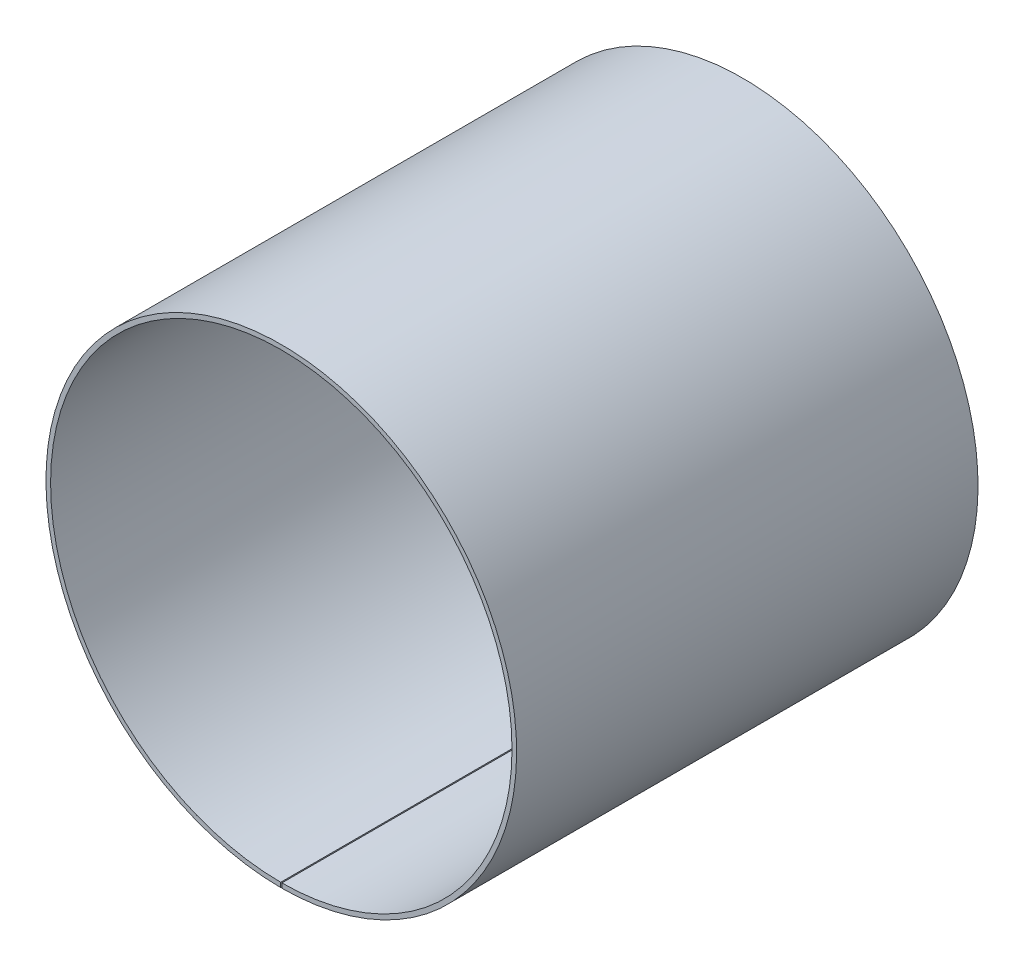
ISO-10303-21;
HEADER;
FILE_DESCRIPTION(('STEP AP214'),'2;1');
FILE_NAME('part.step','',(''),(''),'','','');
FILE_SCHEMA(('AUTOMOTIVE_DESIGN { 1 0 10303 214 1 1 1 1 }'));
ENDSEC;
DATA;
#1=APPLICATION_CONTEXT('core data for automotive mechanical design processes');
#2=APPLICATION_PROTOCOL_DEFINITION('international standard','automotive_design',2000,#1);
#3=PRODUCT_CONTEXT('',#1,'mechanical');
#4=PRODUCT('Part','Part','',(#3));
#5=PRODUCT_RELATED_PRODUCT_CATEGORY('part','',(#4));
#6=PRODUCT_DEFINITION_FORMATION('','',#4);
#7=PRODUCT_DEFINITION_CONTEXT('part definition',#1,'design');
#8=PRODUCT_DEFINITION('design','',#6,#7);
#9=PRODUCT_DEFINITION_SHAPE('','',#8);
#10=(LENGTH_UNIT() NAMED_UNIT(*) SI_UNIT(.MILLI.,.METRE.));
#11=(NAMED_UNIT(*) PLANE_ANGLE_UNIT() SI_UNIT($,.RADIAN.));
#12=(NAMED_UNIT(*) SI_UNIT($,.STERADIAN.) SOLID_ANGLE_UNIT());
#13=UNCERTAINTY_MEASURE_WITH_UNIT(LENGTH_MEASURE(1.E-05),#10,'distance_accuracy_value','');
#14=(GEOMETRIC_REPRESENTATION_CONTEXT(3) GLOBAL_UNCERTAINTY_ASSIGNED_CONTEXT((#13)) GLOBAL_UNIT_ASSIGNED_CONTEXT((#10,
#11,#12)) REPRESENTATION_CONTEXT('',''));
#15=CARTESIAN_POINT('',(0.,0.,0.));
#16=DIRECTION('',(0.,0.,1.));
#17=DIRECTION('',(1.,0.,0.));
#18=AXIS2_PLACEMENT_3D('',#15,#16,#17);
#19=CARTESIAN_POINT('',(0.,0.,200.));
#20=DIRECTION('',(0.,0.,-1.));
#21=DIRECTION('',(-1.,0.,0.));
#22=AXIS2_PLACEMENT_3D('',#19,#20,#21);
#23=CYLINDRICAL_SURFACE('',#22,102.);
#24=CARTESIAN_POINT('',(0.,0.,0.));
#25=DIRECTION('',(0.,0.,1.));
#26=DIRECTION('',(1.,0.,0.));
#27=AXIS2_PLACEMENT_3D('',#24,#25,#26);
#28=CIRCLE('',#27,102.);
#29=CARTESIAN_POINT('',(0.254999999999998,-101.999681249502,0.));
#30=VERTEX_POINT('',#29);
#31=CARTESIAN_POINT('',(-0.255000000000036,-101.999681249502,0.));
#32=VERTEX_POINT('',#31);
#33=EDGE_CURVE('E100',#30,#32,#28,.T.);
#34=ORIENTED_EDGE('',*,*,#33,.T.);
#35=DIRECTION('',(0.,0.,-1.));
#36=VECTOR('',#35,1.);
#37=CARTESIAN_POINT('',(-0.255000000000036,-101.999681249502,200.));
#38=LINE('',#37,#36);
#39=CARTESIAN_POINT('',(-0.255000000000036,-101.999681249502,200.));
#40=VERTEX_POINT('',#39);
#41=EDGE_CURVE('E11',#40,#32,#38,.T.);
#42=ORIENTED_EDGE('',*,*,#41,.F.);
#43=CARTESIAN_POINT('',(0.,0.,200.));
#44=DIRECTION('',(0.,0.,1.));
#45=DIRECTION('',(1.,0.,0.));
#46=AXIS2_PLACEMENT_3D('',#43,#44,#45);
#47=CIRCLE('',#46,102.);
#48=CARTESIAN_POINT('',(0.254999999999998,-101.999681249502,200.));
#49=VERTEX_POINT('',#48);
#50=EDGE_CURVE('E77',#49,#40,#47,.T.);
#51=ORIENTED_EDGE('',*,*,#50,.F.);
#52=DIRECTION('',(0.,0.,-1.));
#53=VECTOR('',#52,1.);
#54=CARTESIAN_POINT('',(0.254999999999998,-101.999681249502,200.));
#55=LINE('',#54,#53);
#56=EDGE_CURVE('E53',#49,#30,#55,.T.);
#57=ORIENTED_EDGE('',*,*,#56,.T.);
#58=EDGE_LOOP('',(#34,#42,#51,#57));
#59=FACE_BOUND('',#58,.T.);
#60=ADVANCED_FACE('F37',(#59),#23,.T.);
#61=CARTESIAN_POINT('',(-0.250000000000035,-99.9996874995117,200.));
#62=DIRECTION('',(0.999996874995117,-0.00250000000000034,0.));
#63=DIRECTION('',(0.00250000000000034,0.999996874995117,0.));
#64=AXIS2_PLACEMENT_3D('',#61,#62,#63);
#65=PLANE('',#64);
#66=DIRECTION('',(-0.00250000000000034,-0.999996874995117,0.));
#67=VECTOR('',#66,1.);
#68=CARTESIAN_POINT('',(-0.250000000000035,-99.9996874995117,0.));
#69=LINE('',#68,#67);
#70=CARTESIAN_POINT('',(-0.250000000000035,-99.9996874995117,0.));
#71=VERTEX_POINT('',#70);
#72=EDGE_CURVE('E86',#71,#32,#69,.T.);
#73=ORIENTED_EDGE('',*,*,#72,.F.);
#74=DIRECTION('',(0.,0.,-1.));
#75=VECTOR('',#74,1.);
#76=CARTESIAN_POINT('',(-0.250000000000035,-99.9996874995117,200.));
#77=LINE('',#76,#75);
#78=CARTESIAN_POINT('',(-0.250000000000035,-99.9996874995117,200.));
#79=VERTEX_POINT('',#78);
#80=EDGE_CURVE('E45',#79,#71,#77,.T.);
#81=ORIENTED_EDGE('',*,*,#80,.F.);
#82=DIRECTION('',(-0.00250000000000034,-0.999996874995117,0.));
#83=VECTOR('',#82,1.);
#84=CARTESIAN_POINT('',(-0.250000000000035,-99.9996874995117,200.));
#85=LINE('',#84,#83);
#86=EDGE_CURVE('E84',#79,#40,#85,.T.);
#87=ORIENTED_EDGE('',*,*,#86,.T.);
#88=ORIENTED_EDGE('',*,*,#41,.T.);
#89=EDGE_LOOP('',(#73,#81,#87,#88));
#90=FACE_BOUND('',#89,.T.);
#91=ADVANCED_FACE('F83',(#90),#65,.T.);
#92=CARTESIAN_POINT('',(0.,0.,200.));
#93=DIRECTION('',(0.,0.,-1.));
#94=DIRECTION('',(-1.,0.,0.));
#95=AXIS2_PLACEMENT_3D('',#92,#93,#94);
#96=CYLINDRICAL_SURFACE('',#95,100.);
#97=CARTESIAN_POINT('',(0.,0.,0.));
#98=DIRECTION('',(0.,0.,1.));
#99=DIRECTION('',(1.,0.,0.));
#100=AXIS2_PLACEMENT_3D('',#97,#98,#99);
#101=CIRCLE('',#100,100.);
#102=CARTESIAN_POINT('',(0.249999999999998,-99.9996874995117,0.));
#103=VERTEX_POINT('',#102);
#104=EDGE_CURVE('E103',#103,#71,#101,.T.);
#105=ORIENTED_EDGE('',*,*,#104,.F.);
#106=DIRECTION('',(0.,0.,-1.));
#107=VECTOR('',#106,1.);
#108=CARTESIAN_POINT('',(0.249999999999998,-99.9996874995117,200.));
#109=LINE('',#108,#107);
#110=CARTESIAN_POINT('',(0.249999999999998,-99.9996874995117,200.));
#111=VERTEX_POINT('',#110);
#112=EDGE_CURVE('E66',#111,#103,#109,.T.);
#113=ORIENTED_EDGE('',*,*,#112,.F.);
#114=CARTESIAN_POINT('',(0.,0.,200.));
#115=DIRECTION('',(0.,0.,1.));
#116=DIRECTION('',(1.,0.,0.));
#117=AXIS2_PLACEMENT_3D('',#114,#115,#116);
#118=CIRCLE('',#117,100.);
#119=EDGE_CURVE('E92',#111,#79,#118,.T.);
#120=ORIENTED_EDGE('',*,*,#119,.T.);
#121=ORIENTED_EDGE('',*,*,#80,.T.);
#122=EDGE_LOOP('',(#105,#113,#120,#121));
#123=FACE_BOUND('',#122,.T.);
#124=ADVANCED_FACE('F94',(#123),#96,.F.);
#125=CARTESIAN_POINT('',(0.254999999999998,-101.999681249502,200.));
#126=DIRECTION('',(-0.999996874995117,-0.00249999999999996,0.));
#127=DIRECTION('',(0.00249999999999996,-0.999996874995117,0.));
#128=AXIS2_PLACEMENT_3D('',#125,#126,#127);
#129=PLANE('',#128);
#130=DIRECTION('',(-0.00249999999999996,0.999996874995117,0.));
#131=VECTOR('',#130,1.);
#132=CARTESIAN_POINT('',(0.254999999999998,-101.999681249502,0.));
#133=LINE('',#132,#131);
#134=EDGE_CURVE('E105',#30,#103,#133,.T.);
#135=ORIENTED_EDGE('',*,*,#134,.F.);
#136=ORIENTED_EDGE('',*,*,#56,.F.);
#137=DIRECTION('',(-0.00249999999999996,0.999996874995117,0.));
#138=VECTOR('',#137,1.);
#139=CARTESIAN_POINT('',(0.254999999999998,-101.999681249502,200.));
#140=LINE('',#139,#138);
#141=EDGE_CURVE('E95',#49,#111,#140,.T.);
#142=ORIENTED_EDGE('',*,*,#141,.T.);
#143=ORIENTED_EDGE('',*,*,#112,.T.);
#144=EDGE_LOOP('',(#135,#136,#142,#143));
#145=FACE_BOUND('',#144,.T.);
#146=ADVANCED_FACE('F111',(#145),#129,.T.);
#147=CARTESIAN_POINT('',(0.,0.,200.));
#148=DIRECTION('',(0.,0.,1.));
#149=DIRECTION('',(1.,0.,0.));
#150=AXIS2_PLACEMENT_3D('',#147,#148,#149);
#151=PLANE('',#150);
#152=ORIENTED_EDGE('',*,*,#50,.T.);
#153=ORIENTED_EDGE('',*,*,#86,.F.);
#154=ORIENTED_EDGE('',*,*,#119,.F.);
#155=ORIENTED_EDGE('',*,*,#141,.F.);
#156=EDGE_LOOP('',(#152,#153,#154,#155));
#157=FACE_BOUND('',#156,.T.);
#158=ADVANCED_FACE('F91',(#157),#151,.T.);
#159=CARTESIAN_POINT('',(0.,0.,0.));
#160=DIRECTION('',(0.,0.,1.));
#161=DIRECTION('',(1.,0.,0.));
#162=AXIS2_PLACEMENT_3D('',#159,#160,#161);
#163=PLANE('',#162);
#164=ORIENTED_EDGE('',*,*,#33,.F.);
#165=ORIENTED_EDGE('',*,*,#134,.T.);
#166=ORIENTED_EDGE('',*,*,#104,.T.);
#167=ORIENTED_EDGE('',*,*,#72,.T.);
#168=EDGE_LOOP('',(#164,#165,#166,#167));
#169=FACE_BOUND('',#168,.T.);
#170=ADVANCED_FACE('F110',(#169),#163,.F.);
#171=CLOSED_SHELL('',(#60,#91,#124,#146,#158,#170));
#172=MANIFOLD_SOLID_BREP('B2',#171);
#173=ADVANCED_BREP_SHAPE_REPRESENTATION('',(#18,#172),#14);
#174=SHAPE_DEFINITION_REPRESENTATION(#9,#173);
ENDSEC;
END-ISO-10303-21;
